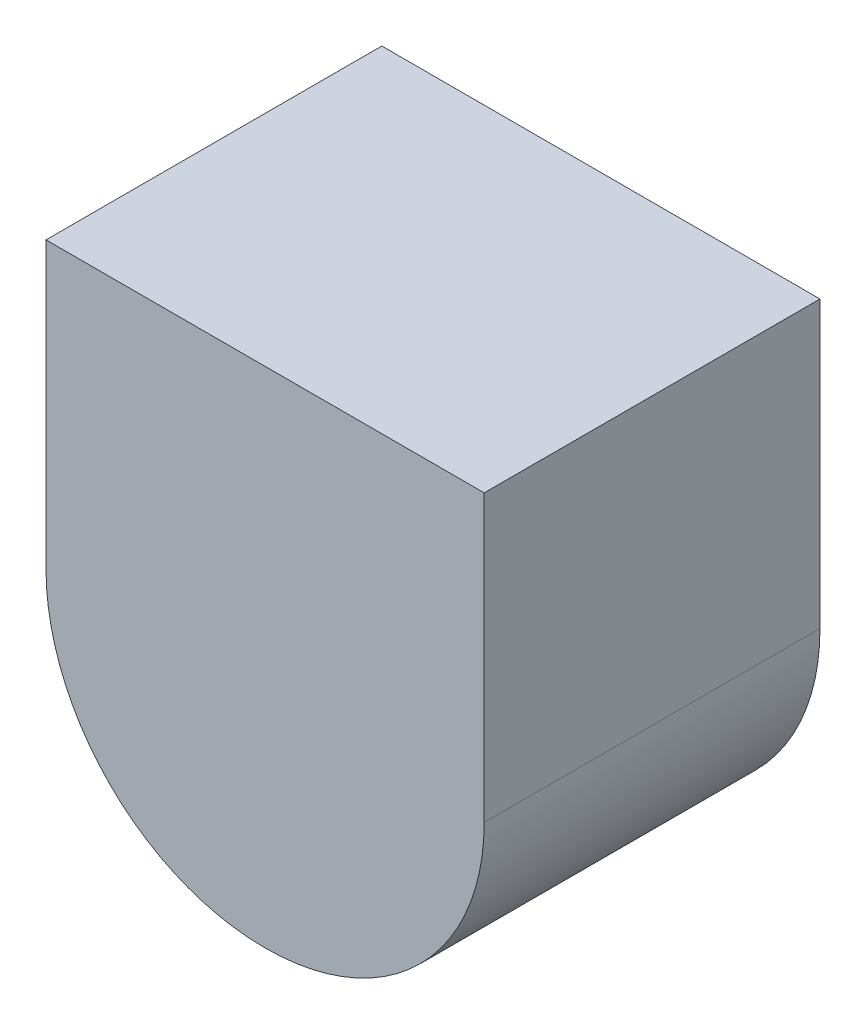
ISO-10303-21;
HEADER;
FILE_DESCRIPTION(('STEP AP214'),'2;1');
FILE_NAME('part.step','',(''),(''),'','','');
FILE_SCHEMA(('AUTOMOTIVE_DESIGN { 1 0 10303 214 1 1 1 1 }'));
ENDSEC;
DATA;
#1=APPLICATION_CONTEXT('core data for automotive mechanical design processes');
#2=APPLICATION_PROTOCOL_DEFINITION('international standard','automotive_design',2000,#1);
#3=PRODUCT_CONTEXT('',#1,'mechanical');
#4=PRODUCT('Part','Part','',(#3));
#5=PRODUCT_RELATED_PRODUCT_CATEGORY('part','',(#4));
#6=PRODUCT_DEFINITION_FORMATION('','',#4);
#7=PRODUCT_DEFINITION_CONTEXT('part definition',#1,'design');
#8=PRODUCT_DEFINITION('design','',#6,#7);
#9=PRODUCT_DEFINITION_SHAPE('','',#8);
#10=(LENGTH_UNIT() NAMED_UNIT(*) SI_UNIT(.MILLI.,.METRE.));
#11=(NAMED_UNIT(*) PLANE_ANGLE_UNIT() SI_UNIT($,.RADIAN.));
#12=(NAMED_UNIT(*) SI_UNIT($,.STERADIAN.) SOLID_ANGLE_UNIT());
#13=UNCERTAINTY_MEASURE_WITH_UNIT(LENGTH_MEASURE(1.E-05),#10,'distance_accuracy_value','');
#14=(GEOMETRIC_REPRESENTATION_CONTEXT(3) GLOBAL_UNCERTAINTY_ASSIGNED_CONTEXT((#13)) GLOBAL_UNIT_ASSIGNED_CONTEXT((#10,
#11,#12)) REPRESENTATION_CONTEXT('',''));
#15=CARTESIAN_POINT('',(0.,0.,0.));
#16=DIRECTION('',(0.,0.,1.));
#17=DIRECTION('',(1.,0.,0.));
#18=AXIS2_PLACEMENT_3D('',#15,#16,#17);
#19=CARTESIAN_POINT('',(1.63049966,2.99999908,0.1999996));
#20=DIRECTION('',(0.,0.,-1.));
#21=DIRECTION('',(-1.,0.,0.));
#22=AXIS2_PLACEMENT_3D('',#19,#20,#21);
#23=PLANE('',#22);
#24=DIRECTION('',(-1.,0.,0.));
#25=VECTOR('',#24,1.);
#26=CARTESIAN_POINT('',(1.36949942,2.69999968,0.1999996));
#27=LINE('',#26,#25);
#28=CARTESIAN_POINT('',(1.50049966,2.69999968,0.1999996));
#29=VERTEX_POINT('',#28);
#30=CARTESIAN_POINT('',(1.49949942,2.69999968,0.1999996));
#31=VERTEX_POINT('',#30);
#32=EDGE_CURVE('E11',#29,#31,#27,.T.);
#33=ORIENTED_EDGE('',*,*,#32,.F.);
#34=CARTESIAN_POINT('',(1.50049966,2.82999968,0.1999996));
#35=DIRECTION('',(0.,0.,-1.));
#36=DIRECTION('',(1.,0.,0.));
#37=AXIS2_PLACEMENT_3D('',#34,#35,#36);
#38=CIRCLE('',#37,0.13);
#39=CARTESIAN_POINT('',(1.63049966,2.82999968,0.1999996));
#40=VERTEX_POINT('',#39);
#41=EDGE_CURVE('E24',#40,#29,#38,.T.);
#42=ORIENTED_EDGE('',*,*,#41,.F.);
#43=DIRECTION('',(0.,-1.,0.));
#44=VECTOR('',#43,1.);
#45=CARTESIAN_POINT('',(1.63049966,2.99999908,0.1999996));
#46=LINE('',#45,#44);
#47=CARTESIAN_POINT('',(1.63049966,2.99999908,0.1999996));
#48=VERTEX_POINT('',#47);
#49=EDGE_CURVE('E117',#48,#40,#46,.T.);
#50=ORIENTED_EDGE('',*,*,#49,.F.);
#51=DIRECTION('',(1.,0.,0.));
#52=VECTOR('',#51,1.);
#53=CARTESIAN_POINT('',(1.63049966,2.99999908,0.1999996));
#54=LINE('',#53,#52);
#55=CARTESIAN_POINT('',(1.36949942,2.99999908,0.1999996));
#56=VERTEX_POINT('',#55);
#57=EDGE_CURVE('E115',#56,#48,#54,.T.);
#58=ORIENTED_EDGE('',*,*,#57,.F.);
#59=DIRECTION('',(0.,1.,0.));
#60=VECTOR('',#59,1.);
#61=CARTESIAN_POINT('',(1.36949942,2.99999908,0.1999996));
#62=LINE('',#61,#60);
#63=CARTESIAN_POINT('',(1.36949942,2.82999968,0.1999996));
#64=VERTEX_POINT('',#63);
#65=EDGE_CURVE('E73',#64,#56,#62,.T.);
#66=ORIENTED_EDGE('',*,*,#65,.F.);
#67=CARTESIAN_POINT('',(1.49949942,2.82999968,0.1999996));
#68=DIRECTION('',(0.,0.,-1.));
#69=DIRECTION('',(1.,0.,0.));
#70=AXIS2_PLACEMENT_3D('',#67,#68,#69);
#71=CIRCLE('',#70,0.13);
#72=EDGE_CURVE('E111',#31,#64,#71,.T.);
#73=ORIENTED_EDGE('',*,*,#72,.F.);
#74=EDGE_LOOP('',(#33,#42,#50,#58,#66,#73));
#75=FACE_BOUND('',#74,.T.);
#76=ADVANCED_FACE('F17',(#75),#23,.F.);
#77=CARTESIAN_POINT('',(1.49949942,2.82999968,0.));
#78=DIRECTION('',(0.,0.,1.));
#79=DIRECTION('',(1.,0.,0.));
#80=AXIS2_PLACEMENT_3D('',#77,#78,#79);
#81=CYLINDRICAL_SURFACE('',#80,0.13);
#82=ORIENTED_EDGE('',*,*,#72,.T.);
#83=DIRECTION('',(0.,0.,-1.));
#84=VECTOR('',#83,1.);
#85=CARTESIAN_POINT('',(1.36949942,2.82999968,0.));
#86=LINE('',#85,#84);
#87=CARTESIAN_POINT('',(1.36949942,2.82999968,0.));
#88=VERTEX_POINT('',#87);
#89=EDGE_CURVE('E109',#64,#88,#86,.T.);
#90=ORIENTED_EDGE('',*,*,#89,.T.);
#91=CARTESIAN_POINT('',(1.49949942,2.82999968,0.));
#92=DIRECTION('',(0.,0.,1.));
#93=DIRECTION('',(1.,0.,0.));
#94=AXIS2_PLACEMENT_3D('',#91,#92,#93);
#95=CIRCLE('',#94,0.13);
#96=CARTESIAN_POINT('',(1.49949942,2.69999968,0.));
#97=VERTEX_POINT('',#96);
#98=EDGE_CURVE('E89',#88,#97,#95,.T.);
#99=ORIENTED_EDGE('',*,*,#98,.T.);
#100=DIRECTION('',(0.,0.,1.));
#101=VECTOR('',#100,1.);
#102=CARTESIAN_POINT('',(1.49949942,2.69999968,0.));
#103=LINE('',#102,#101);
#104=EDGE_CURVE('E105',#97,#31,#103,.T.);
#105=ORIENTED_EDGE('',*,*,#104,.T.);
#106=EDGE_LOOP('',(#82,#90,#99,#105));
#107=FACE_BOUND('',#106,.T.);
#108=ADVANCED_FACE('F127',(#107),#81,.T.);
#109=CARTESIAN_POINT('',(1.36949942,2.69999968,0.));
#110=DIRECTION('',(0.,1.,0.));
#111=DIRECTION('',(-1.,0.,0.));
#112=AXIS2_PLACEMENT_3D('',#109,#110,#111);
#113=PLANE('',#112);
#114=DIRECTION('',(-1.,0.,0.));
#115=VECTOR('',#114,1.);
#116=CARTESIAN_POINT('',(1.63049966,2.69999968,0.));
#117=LINE('',#116,#115);
#118=CARTESIAN_POINT('',(1.50049966,2.69999968,0.));
#119=VERTEX_POINT('',#118);
#120=EDGE_CURVE('E103',#119,#97,#117,.T.);
#121=ORIENTED_EDGE('',*,*,#120,.F.);
#122=DIRECTION('',(0.,0.,-1.));
#123=VECTOR('',#122,1.);
#124=CARTESIAN_POINT('',(1.50049966,2.69999968,0.));
#125=LINE('',#124,#123);
#126=EDGE_CURVE('E100',#29,#119,#125,.T.);
#127=ORIENTED_EDGE('',*,*,#126,.F.);
#128=ORIENTED_EDGE('',*,*,#32,.T.);
#129=ORIENTED_EDGE('',*,*,#104,.F.);
#130=EDGE_LOOP('',(#121,#127,#128,#129));
#131=FACE_BOUND('',#130,.T.);
#132=ADVANCED_FACE('F123',(#131),#113,.F.);
#133=CARTESIAN_POINT('',(1.50049966,2.82999968,0.));
#134=DIRECTION('',(0.,0.,1.));
#135=DIRECTION('',(1.,0.,0.));
#136=AXIS2_PLACEMENT_3D('',#133,#134,#135);
#137=CYLINDRICAL_SURFACE('',#136,0.13);
#138=ORIENTED_EDGE('',*,*,#41,.T.);
#139=ORIENTED_EDGE('',*,*,#126,.T.);
#140=CARTESIAN_POINT('',(1.50049966,2.82999968,0.));
#141=DIRECTION('',(0.,0.,1.));
#142=DIRECTION('',(1.,0.,0.));
#143=AXIS2_PLACEMENT_3D('',#140,#141,#142);
#144=CIRCLE('',#143,0.13);
#145=CARTESIAN_POINT('',(1.63049966,2.82999968,0.));
#146=VERTEX_POINT('',#145);
#147=EDGE_CURVE('E98',#119,#146,#144,.T.);
#148=ORIENTED_EDGE('',*,*,#147,.T.);
#149=DIRECTION('',(0.,0.,1.));
#150=VECTOR('',#149,1.);
#151=CARTESIAN_POINT('',(1.63049966,2.82999968,0.));
#152=LINE('',#151,#150);
#153=EDGE_CURVE('E95',#146,#40,#152,.T.);
#154=ORIENTED_EDGE('',*,*,#153,.T.);
#155=EDGE_LOOP('',(#138,#139,#148,#154));
#156=FACE_BOUND('',#155,.T.);
#157=ADVANCED_FACE('F120',(#156),#137,.T.);
#158=CARTESIAN_POINT('',(1.63049966,2.69999968,0.));
#159=DIRECTION('',(-1.,0.,0.));
#160=DIRECTION('',(0.,-1.,0.));
#161=AXIS2_PLACEMENT_3D('',#158,#159,#160);
#162=PLANE('',#161);
#163=DIRECTION('',(0.,-1.,0.));
#164=VECTOR('',#163,1.);
#165=CARTESIAN_POINT('',(1.63049966,2.69999968,0.));
#166=LINE('',#165,#164);
#167=CARTESIAN_POINT('',(1.63049966,2.99999908,0.));
#168=VERTEX_POINT('',#167);
#169=EDGE_CURVE('E93',#168,#146,#166,.T.);
#170=ORIENTED_EDGE('',*,*,#169,.F.);
#171=DIRECTION('',(0.,0.,-1.));
#172=VECTOR('',#171,1.);
#173=CARTESIAN_POINT('',(1.63049966,2.99999908,0.));
#174=LINE('',#173,#172);
#175=EDGE_CURVE('E76',#48,#168,#174,.T.);
#176=ORIENTED_EDGE('',*,*,#175,.F.);
#177=ORIENTED_EDGE('',*,*,#49,.T.);
#178=ORIENTED_EDGE('',*,*,#153,.F.);
#179=EDGE_LOOP('',(#170,#176,#177,#178));
#180=FACE_BOUND('',#179,.T.);
#181=ADVANCED_FACE('F125',(#180),#162,.F.);
#182=CARTESIAN_POINT('',(1.63049966,2.99999908,0.));
#183=DIRECTION('',(0.,-1.,0.));
#184=DIRECTION('',(1.,0.,0.));
#185=AXIS2_PLACEMENT_3D('',#182,#183,#184);
#186=PLANE('',#185);
#187=DIRECTION('',(0.,0.,-1.));
#188=VECTOR('',#187,1.);
#189=CARTESIAN_POINT('',(1.36949942,2.99999908,0.));
#190=LINE('',#189,#188);
#191=CARTESIAN_POINT('',(1.36949942,2.99999908,0.));
#192=VERTEX_POINT('',#191);
#193=EDGE_CURVE('E67',#56,#192,#190,.T.);
#194=ORIENTED_EDGE('',*,*,#193,.F.);
#195=ORIENTED_EDGE('',*,*,#57,.T.);
#196=ORIENTED_EDGE('',*,*,#175,.T.);
#197=DIRECTION('',(1.,0.,0.));
#198=VECTOR('',#197,1.);
#199=CARTESIAN_POINT('',(1.63049966,2.99999908,0.));
#200=LINE('',#199,#198);
#201=EDGE_CURVE('E77',#192,#168,#200,.T.);
#202=ORIENTED_EDGE('',*,*,#201,.F.);
#203=EDGE_LOOP('',(#194,#195,#196,#202));
#204=FACE_BOUND('',#203,.T.);
#205=ADVANCED_FACE('F81',(#204),#186,.F.);
#206=CARTESIAN_POINT('',(1.36949942,2.99999908,0.));
#207=DIRECTION('',(1.,0.,0.));
#208=DIRECTION('',(0.,1.,0.));
#209=AXIS2_PLACEMENT_3D('',#206,#207,#208);
#210=PLANE('',#209);
#211=DIRECTION('',(0.,1.,0.));
#212=VECTOR('',#211,1.);
#213=CARTESIAN_POINT('',(1.36949942,2.99999908,0.));
#214=LINE('',#213,#212);
#215=EDGE_CURVE('E72',#88,#192,#214,.T.);
#216=ORIENTED_EDGE('',*,*,#215,.F.);
#217=ORIENTED_EDGE('',*,*,#89,.F.);
#218=ORIENTED_EDGE('',*,*,#65,.T.);
#219=ORIENTED_EDGE('',*,*,#193,.T.);
#220=EDGE_LOOP('',(#216,#217,#218,#219));
#221=FACE_BOUND('',#220,.T.);
#222=ADVANCED_FACE('F69',(#221),#210,.F.);
#223=CARTESIAN_POINT('',(1.63049966,2.99999908,0.));
#224=DIRECTION('',(0.,0.,-1.));
#225=DIRECTION('',(-1.,0.,0.));
#226=AXIS2_PLACEMENT_3D('',#223,#224,#225);
#227=PLANE('',#226);
#228=ORIENTED_EDGE('',*,*,#120,.T.);
#229=ORIENTED_EDGE('',*,*,#98,.F.);
#230=ORIENTED_EDGE('',*,*,#215,.T.);
#231=ORIENTED_EDGE('',*,*,#201,.T.);
#232=ORIENTED_EDGE('',*,*,#169,.T.);
#233=ORIENTED_EDGE('',*,*,#147,.F.);
#234=EDGE_LOOP('',(#228,#229,#230,#231,#232,#233));
#235=FACE_BOUND('',#234,.T.);
#236=ADVANCED_FACE('F88',(#235),#227,.T.);
#237=CLOSED_SHELL('',(#76,#108,#132,#157,#181,#205,#222,#236));
#238=MANIFOLD_SOLID_BREP('B1',#237);
#239=ADVANCED_BREP_SHAPE_REPRESENTATION('',(#18,#238),#14);
#240=SHAPE_DEFINITION_REPRESENTATION(#9,#239);
ENDSEC;
END-ISO-10303-21;
